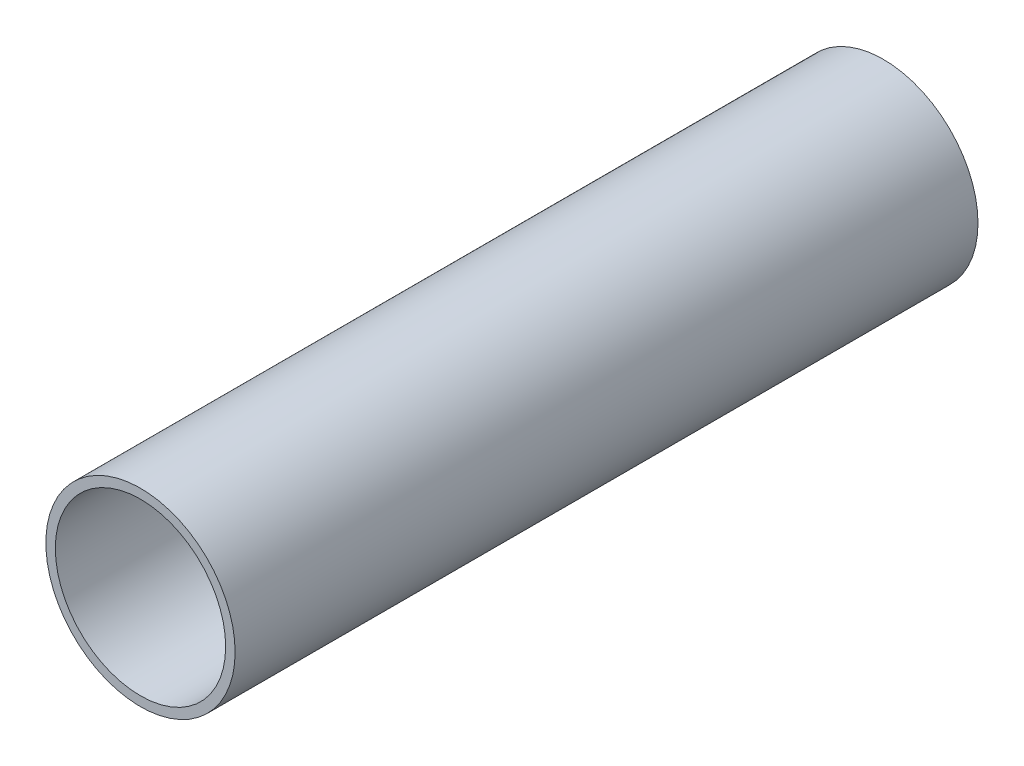
ISO-10303-21;
HEADER;
FILE_DESCRIPTION(('STEP AP214'),'2;1');
FILE_NAME('part.step','',(''),(''),'','','');
FILE_SCHEMA(('AUTOMOTIVE_DESIGN { 1 0 10303 214 1 1 1 1 }'));
ENDSEC;
DATA;
#1=APPLICATION_CONTEXT('core data for automotive mechanical design processes');
#2=APPLICATION_PROTOCOL_DEFINITION('international standard','automotive_design',2000,#1);
#3=PRODUCT_CONTEXT('',#1,'mechanical');
#4=PRODUCT('Part','Part','',(#3));
#5=PRODUCT_RELATED_PRODUCT_CATEGORY('part','',(#4));
#6=PRODUCT_DEFINITION_FORMATION('','',#4);
#7=PRODUCT_DEFINITION_CONTEXT('part definition',#1,'design');
#8=PRODUCT_DEFINITION('design','',#6,#7);
#9=PRODUCT_DEFINITION_SHAPE('','',#8);
#10=(LENGTH_UNIT() NAMED_UNIT(*) SI_UNIT(.MILLI.,.METRE.));
#11=(NAMED_UNIT(*) PLANE_ANGLE_UNIT() SI_UNIT($,.RADIAN.));
#12=(NAMED_UNIT(*) SI_UNIT($,.STERADIAN.) SOLID_ANGLE_UNIT());
#13=UNCERTAINTY_MEASURE_WITH_UNIT(LENGTH_MEASURE(1.E-05),#10,'distance_accuracy_value','');
#14=(GEOMETRIC_REPRESENTATION_CONTEXT(3) GLOBAL_UNCERTAINTY_ASSIGNED_CONTEXT((#13)) GLOBAL_UNIT_ASSIGNED_CONTEXT((#10,
#11,#12)) REPRESENTATION_CONTEXT('',''));
#15=CARTESIAN_POINT('',(0.,0.,0.));
#16=DIRECTION('',(0.,0.,1.));
#17=DIRECTION('',(1.,0.,0.));
#18=AXIS2_PLACEMENT_3D('',#15,#16,#17);
#19=CARTESIAN_POINT('',(0.,0.,157.));
#20=DIRECTION('',(0.,0.,1.));
#21=DIRECTION('',(1.,0.,0.));
#22=AXIS2_PLACEMENT_3D('',#19,#20,#21);
#23=PLANE('',#22);
#24=CARTESIAN_POINT('',(0.,0.,157.));
#25=DIRECTION('',(0.,0.,1.));
#26=DIRECTION('',(1.,0.,0.));
#27=AXIS2_PLACEMENT_3D('',#24,#25,#26);
#28=CIRCLE('',#27,20.);
#29=CARTESIAN_POINT('',(20.,0.,157.));
#30=VERTEX_POINT('',#29);
#31=EDGE_CURVE('E10',#30,#30,#28,.T.);
#32=ORIENTED_EDGE('',*,*,#31,.T.);
#33=EDGE_LOOP('',(#32));
#34=FACE_BOUND('',#33,.T.);
#35=CARTESIAN_POINT('',(0.,0.,157.));
#36=DIRECTION('',(0.,0.,1.));
#37=DIRECTION('',(1.,0.,0.));
#38=AXIS2_PLACEMENT_3D('',#35,#36,#37);
#39=CIRCLE('',#38,18.);
#40=CARTESIAN_POINT('',(18.,0.,157.));
#41=VERTEX_POINT('',#40);
#42=EDGE_CURVE('E42',#41,#41,#39,.T.);
#43=ORIENTED_EDGE('',*,*,#42,.F.);
#44=EDGE_LOOP('',(#43));
#45=FACE_BOUND('',#44,.T.);
#46=ADVANCED_FACE('F31',(#34,#45),#23,.T.);
#47=CARTESIAN_POINT('',(0.,0.,0.));
#48=DIRECTION('',(0.,0.,1.));
#49=DIRECTION('',(1.,0.,0.));
#50=AXIS2_PLACEMENT_3D('',#47,#48,#49);
#51=PLANE('',#50);
#52=CARTESIAN_POINT('',(0.,0.,0.));
#53=DIRECTION('',(0.,0.,1.));
#54=DIRECTION('',(1.,0.,0.));
#55=AXIS2_PLACEMENT_3D('',#52,#53,#54);
#56=CIRCLE('',#55,20.);
#57=CARTESIAN_POINT('',(20.,0.,0.));
#58=VERTEX_POINT('',#57);
#59=EDGE_CURVE('E35',#58,#58,#56,.T.);
#60=ORIENTED_EDGE('',*,*,#59,.F.);
#61=EDGE_LOOP('',(#60));
#62=FACE_BOUND('',#61,.T.);
#63=CARTESIAN_POINT('',(0.,0.,0.));
#64=DIRECTION('',(0.,0.,1.));
#65=DIRECTION('',(1.,0.,0.));
#66=AXIS2_PLACEMENT_3D('',#63,#64,#65);
#67=CIRCLE('',#66,18.);
#68=CARTESIAN_POINT('',(18.,0.,0.));
#69=VERTEX_POINT('',#68);
#70=EDGE_CURVE('E44',#69,#69,#67,.T.);
#71=ORIENTED_EDGE('',*,*,#70,.T.);
#72=EDGE_LOOP('',(#71));
#73=FACE_BOUND('',#72,.T.);
#74=ADVANCED_FACE('F54',(#62,#73),#51,.F.);
#75=CARTESIAN_POINT('',(0.,0.,157.));
#76=DIRECTION('',(0.,0.,-1.));
#77=DIRECTION('',(-1.,0.,0.));
#78=AXIS2_PLACEMENT_3D('',#75,#76,#77);
#79=CYLINDRICAL_SURFACE('',#78,20.);
#80=ORIENTED_EDGE('',*,*,#31,.F.);
#81=EDGE_LOOP('',(#80));
#82=FACE_BOUND('',#81,.T.);
#83=ORIENTED_EDGE('',*,*,#59,.T.);
#84=EDGE_LOOP('',(#83));
#85=FACE_BOUND('',#84,.T.);
#86=ADVANCED_FACE('F33',(#82,#85),#79,.T.);
#87=CARTESIAN_POINT('',(0.,0.,157.));
#88=DIRECTION('',(0.,0.,-1.));
#89=DIRECTION('',(-1.,0.,0.));
#90=AXIS2_PLACEMENT_3D('',#87,#88,#89);
#91=CYLINDRICAL_SURFACE('',#90,18.);
#92=ORIENTED_EDGE('',*,*,#42,.T.);
#93=EDGE_LOOP('',(#92));
#94=FACE_BOUND('',#93,.T.);
#95=ORIENTED_EDGE('',*,*,#70,.F.);
#96=EDGE_LOOP('',(#95));
#97=FACE_BOUND('',#96,.T.);
#98=ADVANCED_FACE('F50',(#94,#97),#91,.F.);
#99=CLOSED_SHELL('',(#46,#74,#86,#98));
#100=MANIFOLD_SOLID_BREP('B2',#99);
#101=ADVANCED_BREP_SHAPE_REPRESENTATION('',(#18,#100),#14);
#102=SHAPE_DEFINITION_REPRESENTATION(#9,#101);
ENDSEC;
END-ISO-10303-21;
